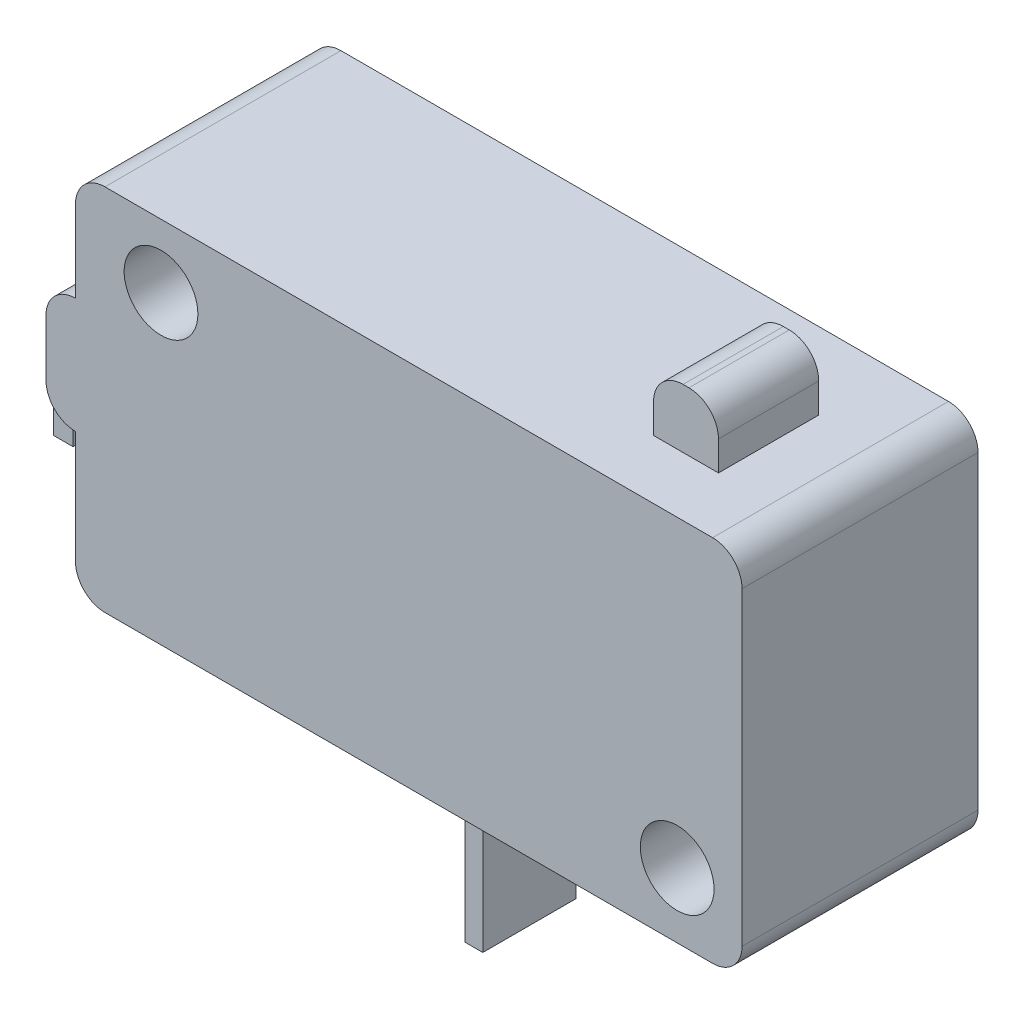
ISO-10303-21;
HEADER;
FILE_DESCRIPTION(('STEP AP214'),'2;1');
FILE_NAME('part.step','',(''),(''),'','','');
FILE_SCHEMA(('AUTOMOTIVE_DESIGN { 1 0 10303 214 1 1 1 1 }'));
ENDSEC;
DATA;
#1=APPLICATION_CONTEXT('core data for automotive mechanical design processes');
#2=APPLICATION_PROTOCOL_DEFINITION('international standard','automotive_design',2000,#1);
#3=PRODUCT_CONTEXT('',#1,'mechanical');
#4=PRODUCT('Part','Part','',(#3));
#5=PRODUCT_RELATED_PRODUCT_CATEGORY('part','',(#4));
#6=PRODUCT_DEFINITION_FORMATION('','',#4);
#7=PRODUCT_DEFINITION_CONTEXT('part definition',#1,'design');
#8=PRODUCT_DEFINITION('design','',#6,#7);
#9=PRODUCT_DEFINITION_SHAPE('','',#8);
#10=(LENGTH_UNIT() NAMED_UNIT(*) SI_UNIT(.MILLI.,.METRE.));
#11=(NAMED_UNIT(*) PLANE_ANGLE_UNIT() SI_UNIT($,.RADIAN.));
#12=(NAMED_UNIT(*) SI_UNIT($,.STERADIAN.) SOLID_ANGLE_UNIT());
#13=UNCERTAINTY_MEASURE_WITH_UNIT(LENGTH_MEASURE(1.E-05),#10,'distance_accuracy_value','');
#14=(GEOMETRIC_REPRESENTATION_CONTEXT(3) GLOBAL_UNCERTAINTY_ASSIGNED_CONTEXT((#13)) GLOBAL_UNIT_ASSIGNED_CONTEXT((#10,
#11,#12)) REPRESENTATION_CONTEXT('',''));
#15=CARTESIAN_POINT('',(0.,0.,0.));
#16=DIRECTION('',(0.,0.,1.));
#17=DIRECTION('',(1.,0.,0.));
#18=AXIS2_PLACEMENT_3D('',#15,#16,#17);
#19=CARTESIAN_POINT('',(0.,15.875,10.16));
#20=DIRECTION('',(0.,-1.,0.));
#21=DIRECTION('',(0.,0.,-1.));
#22=AXIS2_PLACEMENT_3D('',#19,#20,#21);
#23=PLANE('',#22);
#24=DIRECTION('',(-1.,0.,0.));
#25=VECTOR('',#24,1.);
#26=CARTESIAN_POINT('',(0.,15.875,10.16));
#27=LINE('',#26,#25);
#28=CARTESIAN_POINT('',(27.432,15.875,10.16));
#29=VERTEX_POINT('',#28);
#30=CARTESIAN_POINT('',(1.27,15.875,10.16));
#31=VERTEX_POINT('',#30);
#32=EDGE_CURVE('E317',#29,#31,#27,.T.);
#33=ORIENTED_EDGE('',*,*,#32,.F.);
#34=DIRECTION('',(0.,0.,-1.));
#35=VECTOR('',#34,1.);
#36=CARTESIAN_POINT('',(27.432,15.875,10.16));
#37=LINE('',#36,#35);
#38=CARTESIAN_POINT('',(27.432,15.875,0.));
#39=VERTEX_POINT('',#38);
#40=EDGE_CURVE('E191',#29,#39,#37,.T.);
#41=ORIENTED_EDGE('',*,*,#40,.T.);
#42=DIRECTION('',(-1.,0.,0.));
#43=VECTOR('',#42,1.);
#44=CARTESIAN_POINT('',(0.,15.875,0.));
#45=LINE('',#44,#43);
#46=CARTESIAN_POINT('',(1.27,15.875,0.));
#47=VERTEX_POINT('',#46);
#48=EDGE_CURVE('E326',#39,#47,#45,.T.);
#49=ORIENTED_EDGE('',*,*,#48,.T.);
#50=DIRECTION('',(0.,0.,-1.));
#51=VECTOR('',#50,1.);
#52=CARTESIAN_POINT('',(1.27,15.875,10.16));
#53=LINE('',#52,#51);
#54=EDGE_CURVE('E188',#47,#31,#53,.F.);
#55=ORIENTED_EDGE('',*,*,#54,.T.);
#56=EDGE_LOOP('',(#33,#41,#49,#55));
#57=FACE_BOUND('',#56,.T.);
#58=DIRECTION('',(0.,0.,1.));
#59=VECTOR('',#58,1.);
#60=CARTESIAN_POINT('',(22.352,15.875,3.302));
#61=LINE('',#60,#59);
#62=CARTESIAN_POINT('',(22.352,15.875,3.302));
#63=VERTEX_POINT('',#62);
#64=CARTESIAN_POINT('',(22.352,15.875,7.62));
#65=VERTEX_POINT('',#64);
#66=EDGE_CURVE('E897',#63,#65,#61,.T.);
#67=ORIENTED_EDGE('',*,*,#66,.F.);
#68=DIRECTION('',(-1.,0.,0.));
#69=VECTOR('',#68,1.);
#70=CARTESIAN_POINT('',(22.352,15.875,3.302));
#71=LINE('',#70,#69);
#72=CARTESIAN_POINT('',(25.146,15.875,3.302));
#73=VERTEX_POINT('',#72);
#74=EDGE_CURVE('E907',#73,#63,#71,.T.);
#75=ORIENTED_EDGE('',*,*,#74,.F.);
#76=DIRECTION('',(0.,0.,-1.));
#77=VECTOR('',#76,1.);
#78=CARTESIAN_POINT('',(25.146,15.875,3.302));
#79=LINE('',#78,#77);
#80=CARTESIAN_POINT('',(25.146,15.875,7.62));
#81=VERTEX_POINT('',#80);
#82=EDGE_CURVE('E915',#81,#73,#79,.T.);
#83=ORIENTED_EDGE('',*,*,#82,.F.);
#84=DIRECTION('',(1.,0.,0.));
#85=VECTOR('',#84,1.);
#86=CARTESIAN_POINT('',(22.352,15.875,7.62));
#87=LINE('',#86,#85);
#88=EDGE_CURVE('E910',#65,#81,#87,.T.);
#89=ORIENTED_EDGE('',*,*,#88,.F.);
#90=EDGE_LOOP('',(#67,#75,#83,#89));
#91=FACE_BOUND('',#90,.T.);
#92=ADVANCED_FACE('F34',(#57,#91),#23,.F.);
#93=CARTESIAN_POINT('',(0.,0.,10.16));
#94=DIRECTION('',(1.,0.,0.));
#95=DIRECTION('',(0.,0.,-1.));
#96=AXIS2_PLACEMENT_3D('',#93,#94,#95);
#97=PLANE('',#96);
#98=DIRECTION('',(0.,-1.,0.));
#99=VECTOR('',#98,1.);
#100=CARTESIAN_POINT('',(0.,0.,0.));
#101=LINE('',#100,#99);
#102=CARTESIAN_POINT('',(0.,6.12033233552722,0.));
#103=VERTEX_POINT('',#102);
#104=CARTESIAN_POINT('',(0.,1.27,0.));
#105=VERTEX_POINT('',#104);
#106=EDGE_CURVE('E227',#103,#105,#101,.T.);
#107=ORIENTED_EDGE('',*,*,#106,.T.);
#108=DIRECTION('',(0.,0.,-1.));
#109=VECTOR('',#108,1.);
#110=CARTESIAN_POINT('',(0.,1.27,10.16));
#111=LINE('',#110,#109);
#112=CARTESIAN_POINT('',(0.,1.27,10.16));
#113=VERTEX_POINT('',#112);
#114=EDGE_CURVE('E185',#105,#113,#111,.F.);
#115=ORIENTED_EDGE('',*,*,#114,.T.);
#116=DIRECTION('',(0.,-1.,0.));
#117=VECTOR('',#116,1.);
#118=CARTESIAN_POINT('',(0.,0.,10.16));
#119=LINE('',#118,#117);
#120=CARTESIAN_POINT('',(0.,6.12033233552722,10.16));
#121=VERTEX_POINT('',#120);
#122=EDGE_CURVE('E311',#121,#113,#119,.T.);
#123=ORIENTED_EDGE('',*,*,#122,.F.);
#124=DIRECTION('',(0.,0.,1.));
#125=VECTOR('',#124,1.);
#126=CARTESIAN_POINT('',(0.,6.12033233552722,0.));
#127=LINE('',#126,#125);
#128=EDGE_CURVE('E230',#103,#121,#127,.T.);
#129=ORIENTED_EDGE('',*,*,#128,.F.);
#130=EDGE_LOOP('',(#107,#115,#123,#129));
#131=FACE_BOUND('',#130,.T.);
#132=ADVANCED_FACE('F429',(#131),#97,.F.);
#133=CARTESIAN_POINT('',(0.,14.605,10.16));
#134=VERTEX_POINT('',#133);
#135=CARTESIAN_POINT('',(0.,11.0867035321363,10.16));
#136=VERTEX_POINT('',#135);
#137=EDGE_CURVE('E308',#134,#136,#119,.T.);
#138=ORIENTED_EDGE('',*,*,#137,.F.);
#139=DIRECTION('',(0.,0.,-1.));
#140=VECTOR('',#139,1.);
#141=CARTESIAN_POINT('',(0.,14.605,10.16));
#142=LINE('',#141,#140);
#143=CARTESIAN_POINT('',(0.,14.605,0.));
#144=VERTEX_POINT('',#143);
#145=EDGE_CURVE('E194',#134,#144,#142,.T.);
#146=ORIENTED_EDGE('',*,*,#145,.T.);
#147=CARTESIAN_POINT('',(0.,11.0867035321363,0.));
#148=VERTEX_POINT('',#147);
#149=EDGE_CURVE('E214',#144,#148,#101,.T.);
#150=ORIENTED_EDGE('',*,*,#149,.T.);
#151=DIRECTION('',(0.,0.,-1.));
#152=VECTOR('',#151,1.);
#153=CARTESIAN_POINT('',(0.,11.0867035321363,0.));
#154=LINE('',#153,#152);
#155=EDGE_CURVE('E224',#136,#148,#154,.T.);
#156=ORIENTED_EDGE('',*,*,#155,.F.);
#157=EDGE_LOOP('',(#138,#146,#150,#156));
#158=FACE_BOUND('',#157,.T.);
#159=ADVANCED_FACE('F223',(#158),#97,.F.);
#160=CARTESIAN_POINT('',(0.,0.,10.16));
#161=DIRECTION('',(0.,1.,0.));
#162=DIRECTION('',(0.,0.,1.));
#163=AXIS2_PLACEMENT_3D('',#160,#161,#162);
#164=PLANE('',#163);
#165=DIRECTION('',(1.,0.,0.));
#166=VECTOR('',#165,1.);
#167=CARTESIAN_POINT('',(0.,0.,0.));
#168=LINE('',#167,#166);
#169=CARTESIAN_POINT('',(1.27,0.,0.));
#170=VERTEX_POINT('',#169);
#171=CARTESIAN_POINT('',(27.432,0.,0.));
#172=VERTEX_POINT('',#171);
#173=EDGE_CURVE('E226',#170,#172,#168,.T.);
#174=ORIENTED_EDGE('',*,*,#173,.T.);
#175=DIRECTION('',(0.,0.,-1.));
#176=VECTOR('',#175,1.);
#177=CARTESIAN_POINT('',(27.432,0.,10.16));
#178=LINE('',#177,#176);
#179=CARTESIAN_POINT('',(27.432,0.,10.16));
#180=VERTEX_POINT('',#179);
#181=EDGE_CURVE('E170',#172,#180,#178,.F.);
#182=ORIENTED_EDGE('',*,*,#181,.T.);
#183=DIRECTION('',(1.,0.,0.));
#184=VECTOR('',#183,1.);
#185=CARTESIAN_POINT('',(0.,0.,10.16));
#186=LINE('',#185,#184);
#187=CARTESIAN_POINT('',(1.27,0.,10.16));
#188=VERTEX_POINT('',#187);
#189=EDGE_CURVE('E310',#188,#180,#186,.T.);
#190=ORIENTED_EDGE('',*,*,#189,.F.);
#191=DIRECTION('',(0.,0.,-1.));
#192=VECTOR('',#191,1.);
#193=CARTESIAN_POINT('',(1.27,0.,10.16));
#194=LINE('',#193,#192);
#195=EDGE_CURVE('E167',#188,#170,#194,.T.);
#196=ORIENTED_EDGE('',*,*,#195,.T.);
#197=EDGE_LOOP('',(#174,#182,#190,#196));
#198=FACE_BOUND('',#197,.T.);
#199=DIRECTION('',(0.,0.,-1.));
#200=VECTOR('',#199,1.);
#201=CARTESIAN_POINT('',(14.9668113061045,0.,4.32932291865937));
#202=LINE('',#201,#200);
#203=CARTESIAN_POINT('',(14.9668113061045,0.,8.35123363118148));
#204=VERTEX_POINT('',#203);
#205=CARTESIAN_POINT('',(14.9668113061045,0.,4.32932291865937));
#206=VERTEX_POINT('',#205);
#207=EDGE_CURVE('E264',#204,#206,#202,.T.);
#208=ORIENTED_EDGE('',*,*,#207,.F.);
#209=DIRECTION('',(-1.,0.,0.));
#210=VECTOR('',#209,1.);
#211=CARTESIAN_POINT('',(14.9668113061045,0.,8.35123363118148));
#212=LINE('',#211,#210);
#213=CARTESIAN_POINT('',(15.7304652388619,0.,8.35123363118148));
#214=VERTEX_POINT('',#213);
#215=EDGE_CURVE('E269',#214,#204,#212,.T.);
#216=ORIENTED_EDGE('',*,*,#215,.F.);
#217=DIRECTION('',(0.,0.,1.));
#218=VECTOR('',#217,1.);
#219=CARTESIAN_POINT('',(15.7304652388619,0.,4.32932291865937));
#220=LINE('',#219,#218);
#221=CARTESIAN_POINT('',(15.7304652388619,0.,4.32932291865937));
#222=VERTEX_POINT('',#221);
#223=EDGE_CURVE('E284',#222,#214,#220,.T.);
#224=ORIENTED_EDGE('',*,*,#223,.F.);
#225=DIRECTION('',(1.,0.,0.));
#226=VECTOR('',#225,1.);
#227=CARTESIAN_POINT('',(14.9668113061045,0.,4.32932291865937));
#228=LINE('',#227,#226);
#229=EDGE_CURVE('E281',#206,#222,#228,.T.);
#230=ORIENTED_EDGE('',*,*,#229,.F.);
#231=EDGE_LOOP('',(#208,#216,#224,#230));
#232=FACE_BOUND('',#231,.T.);
#233=ADVANCED_FACE('F437',(#198,#232),#164,.F.);
#234=CARTESIAN_POINT('',(28.702,0.,10.16));
#235=DIRECTION('',(-1.,0.,0.));
#236=DIRECTION('',(0.,0.,1.));
#237=AXIS2_PLACEMENT_3D('',#234,#235,#236);
#238=PLANE('',#237);
#239=DIRECTION('',(0.,1.,0.));
#240=VECTOR('',#239,1.);
#241=CARTESIAN_POINT('',(28.702,0.,10.16));
#242=LINE('',#241,#240);
#243=CARTESIAN_POINT('',(28.702,1.27,10.16));
#244=VERTEX_POINT('',#243);
#245=CARTESIAN_POINT('',(28.702,14.605,10.16));
#246=VERTEX_POINT('',#245);
#247=EDGE_CURVE('E314',#244,#246,#242,.T.);
#248=ORIENTED_EDGE('',*,*,#247,.F.);
#249=DIRECTION('',(0.,0.,-1.));
#250=VECTOR('',#249,1.);
#251=CARTESIAN_POINT('',(28.702,1.27,10.16));
#252=LINE('',#251,#250);
#253=CARTESIAN_POINT('',(28.702,1.27,0.));
#254=VERTEX_POINT('',#253);
#255=EDGE_CURVE('E152',#244,#254,#252,.T.);
#256=ORIENTED_EDGE('',*,*,#255,.T.);
#257=DIRECTION('',(0.,1.,0.));
#258=VECTOR('',#257,1.);
#259=CARTESIAN_POINT('',(28.702,0.,0.));
#260=LINE('',#259,#258);
#261=CARTESIAN_POINT('',(28.702,14.605,0.));
#262=VERTEX_POINT('',#261);
#263=EDGE_CURVE('E323',#254,#262,#260,.T.);
#264=ORIENTED_EDGE('',*,*,#263,.T.);
#265=DIRECTION('',(0.,0.,-1.));
#266=VECTOR('',#265,1.);
#267=CARTESIAN_POINT('',(28.702,14.605,10.16));
#268=LINE('',#267,#266);
#269=EDGE_CURVE('E149',#262,#246,#268,.F.);
#270=ORIENTED_EDGE('',*,*,#269,.T.);
#271=EDGE_LOOP('',(#248,#256,#264,#270));
#272=FACE_BOUND('',#271,.T.);
#273=ADVANCED_FACE('F447',(#272),#238,.F.);
#274=CARTESIAN_POINT('',(0.,0.,10.16));
#275=DIRECTION('',(0.,0.,-1.));
#276=DIRECTION('',(-1.,0.,0.));
#277=AXIS2_PLACEMENT_3D('',#274,#275,#276);
#278=PLANE('',#277);
#279=CARTESIAN_POINT('',(25.908,2.794,10.16));
#280=DIRECTION('',(0.,0.,1.));
#281=DIRECTION('',(1.,0.,0.));
#282=AXIS2_PLACEMENT_3D('',#279,#280,#281);
#283=CIRCLE('',#282,1.5875);
#284=CARTESIAN_POINT('',(27.4955,2.794,10.16));
#285=VERTEX_POINT('',#284);
#286=EDGE_CURVE('E300',#285,#285,#283,.T.);
#287=ORIENTED_EDGE('',*,*,#286,.F.);
#288=EDGE_LOOP('',(#287));
#289=FACE_BOUND('',#288,.T.);
#290=CARTESIAN_POINT('',(3.68299999999999,13.1318,10.16));
#291=DIRECTION('',(0.,0.,1.));
#292=DIRECTION('',(1.,0.,0.));
#293=AXIS2_PLACEMENT_3D('',#290,#291,#292);
#294=CIRCLE('',#293,1.5875);
#295=CARTESIAN_POINT('',(5.27049999999999,13.1318,10.16));
#296=VERTEX_POINT('',#295);
#297=EDGE_CURVE('E304',#296,#296,#294,.T.);
#298=ORIENTED_EDGE('',*,*,#297,.F.);
#299=EDGE_LOOP('',(#298));
#300=FACE_BOUND('',#299,.T.);
#301=DIRECTION('',(0.,1.,0.));
#302=VECTOR('',#301,1.);
#303=CARTESIAN_POINT('',(-1.27,6.12033233552722,10.16));
#304=LINE('',#303,#302);
#305=CARTESIAN_POINT('',(-1.27,7.39033233552722,10.16));
#306=VERTEX_POINT('',#305);
#307=CARTESIAN_POINT('',(-1.27,9.81670353213626,10.16));
#308=VERTEX_POINT('',#307);
#309=EDGE_CURVE('E106',#306,#308,#304,.T.);
#310=ORIENTED_EDGE('',*,*,#309,.F.);
#311=CARTESIAN_POINT('',(0.,7.39033233552722,10.16));
#312=DIRECTION('',(0.,0.,-1.));
#313=DIRECTION('',(-1.,0.,0.));
#314=AXIS2_PLACEMENT_3D('',#311,#312,#313);
#315=CIRCLE('',#314,1.27);
#316=EDGE_CURVE('E204',#306,#121,#315,.F.);
#317=ORIENTED_EDGE('',*,*,#316,.T.);
#318=ORIENTED_EDGE('',*,*,#122,.T.);
#319=CARTESIAN_POINT('',(1.27,1.27,10.16));
#320=DIRECTION('',(0.,0.,-1.));
#321=DIRECTION('',(-1.,0.,0.));
#322=AXIS2_PLACEMENT_3D('',#319,#320,#321);
#323=CIRCLE('',#322,1.27);
#324=EDGE_CURVE('E179',#113,#188,#323,.F.);
#325=ORIENTED_EDGE('',*,*,#324,.T.);
#326=ORIENTED_EDGE('',*,*,#189,.T.);
#327=CARTESIAN_POINT('',(27.432,1.27,10.16));
#328=DIRECTION('',(0.,0.,-1.));
#329=DIRECTION('',(-1.,0.,0.));
#330=AXIS2_PLACEMENT_3D('',#327,#328,#329);
#331=CIRCLE('',#330,1.27);
#332=EDGE_CURVE('E182',#180,#244,#331,.F.);
#333=ORIENTED_EDGE('',*,*,#332,.T.);
#334=ORIENTED_EDGE('',*,*,#247,.T.);
#335=CARTESIAN_POINT('',(27.432,14.605,10.16));
#336=DIRECTION('',(0.,0.,-1.));
#337=DIRECTION('',(-1.,0.,0.));
#338=AXIS2_PLACEMENT_3D('',#335,#336,#337);
#339=CIRCLE('',#338,1.27);
#340=EDGE_CURVE('E176',#246,#29,#339,.F.);
#341=ORIENTED_EDGE('',*,*,#340,.T.);
#342=ORIENTED_EDGE('',*,*,#32,.T.);
#343=CARTESIAN_POINT('',(1.27,14.605,10.16));
#344=DIRECTION('',(0.,0.,-1.));
#345=DIRECTION('',(-1.,0.,0.));
#346=AXIS2_PLACEMENT_3D('',#343,#344,#345);
#347=CIRCLE('',#346,1.27);
#348=EDGE_CURVE('E173',#31,#134,#347,.F.);
#349=ORIENTED_EDGE('',*,*,#348,.T.);
#350=ORIENTED_EDGE('',*,*,#137,.T.);
#351=CARTESIAN_POINT('',(0.,9.81670353213626,10.16));
#352=DIRECTION('',(0.,0.,-1.));
#353=DIRECTION('',(-1.,0.,0.));
#354=AXIS2_PLACEMENT_3D('',#351,#352,#353);
#355=CIRCLE('',#354,1.27);
#356=EDGE_CURVE('E53',#136,#308,#355,.F.);
#357=ORIENTED_EDGE('',*,*,#356,.T.);
#358=EDGE_LOOP('',(#310,#317,#318,#325,#326,#333,#334,#341,#342,#349,#350,#357));
#359=FACE_BOUND('',#358,.T.);
#360=ADVANCED_FACE('F426',(#289,#300,#359),#278,.F.);
#361=CARTESIAN_POINT('',(0.,0.,0.));
#362=DIRECTION('',(0.,0.,-1.));
#363=DIRECTION('',(-1.,0.,0.));
#364=AXIS2_PLACEMENT_3D('',#361,#362,#363);
#365=PLANE('',#364);
#366=CARTESIAN_POINT('',(25.908,2.794,0.));
#367=DIRECTION('',(0.,0.,-1.));
#368=DIRECTION('',(-1.,0.,0.));
#369=AXIS2_PLACEMENT_3D('',#366,#367,#368);
#370=CIRCLE('',#369,1.5875);
#371=CARTESIAN_POINT('',(24.3205,2.794,0.));
#372=VERTEX_POINT('',#371);
#373=EDGE_CURVE('E303',#372,#372,#370,.T.);
#374=ORIENTED_EDGE('',*,*,#373,.F.);
#375=EDGE_LOOP('',(#374));
#376=FACE_BOUND('',#375,.T.);
#377=CARTESIAN_POINT('',(3.68299999999999,13.1318,0.));
#378=DIRECTION('',(0.,0.,-1.));
#379=DIRECTION('',(-1.,0.,0.));
#380=AXIS2_PLACEMENT_3D('',#377,#378,#379);
#381=CIRCLE('',#380,1.5875);
#382=CARTESIAN_POINT('',(2.09549999999999,13.1318,0.));
#383=VERTEX_POINT('',#382);
#384=EDGE_CURVE('E307',#383,#383,#381,.T.);
#385=ORIENTED_EDGE('',*,*,#384,.F.);
#386=EDGE_LOOP('',(#385));
#387=FACE_BOUND('',#386,.T.);
#388=ORIENTED_EDGE('',*,*,#106,.F.);
#389=CARTESIAN_POINT('',(0.,7.39033233552722,0.));
#390=DIRECTION('',(0.,0.,-1.));
#391=DIRECTION('',(-1.,0.,0.));
#392=AXIS2_PLACEMENT_3D('',#389,#390,#391);
#393=CIRCLE('',#392,1.27);
#394=CARTESIAN_POINT('',(-1.27,7.39033233552722,0.));
#395=VERTEX_POINT('',#394);
#396=EDGE_CURVE('E11',#103,#395,#393,.T.);
#397=ORIENTED_EDGE('',*,*,#396,.T.);
#398=DIRECTION('',(0.,-1.,0.));
#399=VECTOR('',#398,1.);
#400=CARTESIAN_POINT('',(-1.27,6.12033233552722,0.));
#401=LINE('',#400,#399);
#402=CARTESIAN_POINT('',(-1.27,9.81670353213626,0.));
#403=VERTEX_POINT('',#402);
#404=EDGE_CURVE('E108',#403,#395,#401,.T.);
#405=ORIENTED_EDGE('',*,*,#404,.F.);
#406=CARTESIAN_POINT('',(0.,9.81670353213626,0.));
#407=DIRECTION('',(0.,0.,-1.));
#408=DIRECTION('',(-1.,0.,0.));
#409=AXIS2_PLACEMENT_3D('',#406,#407,#408);
#410=CIRCLE('',#409,1.27);
#411=EDGE_CURVE('E44',#403,#148,#410,.T.);
#412=ORIENTED_EDGE('',*,*,#411,.T.);
#413=ORIENTED_EDGE('',*,*,#149,.F.);
#414=CARTESIAN_POINT('',(1.27,14.605,0.));
#415=DIRECTION('',(0.,0.,-1.));
#416=DIRECTION('',(-1.,0.,0.));
#417=AXIS2_PLACEMENT_3D('',#414,#415,#416);
#418=CIRCLE('',#417,1.27);
#419=EDGE_CURVE('E155',#144,#47,#418,.T.);
#420=ORIENTED_EDGE('',*,*,#419,.T.);
#421=ORIENTED_EDGE('',*,*,#48,.F.);
#422=CARTESIAN_POINT('',(27.432,14.605,0.));
#423=DIRECTION('',(0.,0.,-1.));
#424=DIRECTION('',(-1.,0.,0.));
#425=AXIS2_PLACEMENT_3D('',#422,#423,#424);
#426=CIRCLE('',#425,1.27);
#427=EDGE_CURVE('E158',#39,#262,#426,.T.);
#428=ORIENTED_EDGE('',*,*,#427,.T.);
#429=ORIENTED_EDGE('',*,*,#263,.F.);
#430=CARTESIAN_POINT('',(27.432,1.27,0.));
#431=DIRECTION('',(0.,0.,-1.));
#432=DIRECTION('',(-1.,0.,0.));
#433=AXIS2_PLACEMENT_3D('',#430,#431,#432);
#434=CIRCLE('',#433,1.27);
#435=EDGE_CURVE('E164',#254,#172,#434,.T.);
#436=ORIENTED_EDGE('',*,*,#435,.T.);
#437=ORIENTED_EDGE('',*,*,#173,.F.);
#438=CARTESIAN_POINT('',(1.27,1.27,0.));
#439=DIRECTION('',(0.,0.,-1.));
#440=DIRECTION('',(-1.,0.,0.));
#441=AXIS2_PLACEMENT_3D('',#438,#439,#440);
#442=CIRCLE('',#441,1.27);
#443=EDGE_CURVE('E161',#170,#105,#442,.T.);
#444=ORIENTED_EDGE('',*,*,#443,.T.);
#445=EDGE_LOOP('',(#388,#397,#405,#412,#413,#420,#421,#428,#429,#436,#437,#444));
#446=FACE_BOUND('',#445,.T.);
#447=ADVANCED_FACE('F212',(#376,#387,#446),#365,.T.);
#448=CARTESIAN_POINT('',(3.68299999999999,13.1318,-2.2606));
#449=DIRECTION('',(0.,0.,1.));
#450=DIRECTION('',(1.,0.,0.));
#451=AXIS2_PLACEMENT_3D('',#448,#449,#450);
#452=CYLINDRICAL_SURFACE('',#451,1.5875);
#453=ORIENTED_EDGE('',*,*,#384,.T.);
#454=EDGE_LOOP('',(#453));
#455=FACE_BOUND('',#454,.T.);
#456=ORIENTED_EDGE('',*,*,#297,.T.);
#457=EDGE_LOOP('',(#456));
#458=FACE_BOUND('',#457,.T.);
#459=ADVANCED_FACE('F558',(#455,#458),#452,.F.);
#460=CARTESIAN_POINT('',(25.908,2.794,-2.2606));
#461=DIRECTION('',(0.,0.,1.));
#462=DIRECTION('',(1.,0.,0.));
#463=AXIS2_PLACEMENT_3D('',#460,#461,#462);
#464=CYLINDRICAL_SURFACE('',#463,1.5875);
#465=ORIENTED_EDGE('',*,*,#373,.T.);
#466=EDGE_LOOP('',(#465));
#467=FACE_BOUND('',#466,.T.);
#468=ORIENTED_EDGE('',*,*,#286,.T.);
#469=EDGE_LOOP('',(#468));
#470=FACE_BOUND('',#469,.T.);
#471=ADVANCED_FACE('F805',(#467,#470),#464,.F.);
#472=CARTESIAN_POINT('',(14.9668113061045,-6.35,4.32932291865937));
#473=DIRECTION('',(1.,0.,0.));
#474=DIRECTION('',(0.,0.,-1.));
#475=AXIS2_PLACEMENT_3D('',#472,#473,#474);
#476=PLANE('',#475);
#477=ORIENTED_EDGE('',*,*,#207,.T.);
#478=DIRECTION('',(0.,1.,0.));
#479=VECTOR('',#478,1.);
#480=CARTESIAN_POINT('',(14.9668113061045,-6.35,4.32932291865937));
#481=LINE('',#480,#479);
#482=CARTESIAN_POINT('',(14.9668113061045,-6.35,4.32932291865937));
#483=VERTEX_POINT('',#482);
#484=EDGE_CURVE('E297',#483,#206,#481,.T.);
#485=ORIENTED_EDGE('',*,*,#484,.F.);
#486=DIRECTION('',(0.,0.,-1.));
#487=VECTOR('',#486,1.);
#488=CARTESIAN_POINT('',(14.9668113061045,-6.35,4.32932291865937));
#489=LINE('',#488,#487);
#490=CARTESIAN_POINT('',(14.9668113061045,-6.35,8.35123363118148));
#491=VERTEX_POINT('',#490);
#492=EDGE_CURVE('E265',#491,#483,#489,.T.);
#493=ORIENTED_EDGE('',*,*,#492,.F.);
#494=DIRECTION('',(0.,1.,0.));
#495=VECTOR('',#494,1.);
#496=CARTESIAN_POINT('',(14.9668113061045,-6.35,8.35123363118148));
#497=LINE('',#496,#495);
#498=EDGE_CURVE('E278',#491,#204,#497,.T.);
#499=ORIENTED_EDGE('',*,*,#498,.T.);
#500=EDGE_LOOP('',(#477,#485,#493,#499));
#501=FACE_BOUND('',#500,.T.);
#502=ADVANCED_FACE('F796',(#501),#476,.F.);
#503=CARTESIAN_POINT('',(14.9668113061045,-6.35,4.32932291865937));
#504=DIRECTION('',(0.,0.,1.));
#505=DIRECTION('',(1.,0.,0.));
#506=AXIS2_PLACEMENT_3D('',#503,#504,#505);
#507=PLANE('',#506);
#508=ORIENTED_EDGE('',*,*,#229,.T.);
#509=DIRECTION('',(0.,1.,0.));
#510=VECTOR('',#509,1.);
#511=CARTESIAN_POINT('',(15.7304652388619,-6.35,4.32932291865937));
#512=LINE('',#511,#510);
#513=CARTESIAN_POINT('',(15.7304652388619,-6.35,4.32932291865937));
#514=VERTEX_POINT('',#513);
#515=EDGE_CURVE('E294',#514,#222,#512,.T.);
#516=ORIENTED_EDGE('',*,*,#515,.F.);
#517=DIRECTION('',(1.,0.,0.));
#518=VECTOR('',#517,1.);
#519=CARTESIAN_POINT('',(14.9668113061045,-6.35,4.32932291865937));
#520=LINE('',#519,#518);
#521=EDGE_CURVE('E268',#483,#514,#520,.T.);
#522=ORIENTED_EDGE('',*,*,#521,.F.);
#523=ORIENTED_EDGE('',*,*,#484,.T.);
#524=EDGE_LOOP('',(#508,#516,#522,#523));
#525=FACE_BOUND('',#524,.T.);
#526=ADVANCED_FACE('F787',(#525),#507,.F.);
#527=CARTESIAN_POINT('',(15.7304652388619,-6.35,4.32932291865937));
#528=DIRECTION('',(-1.,0.,0.));
#529=DIRECTION('',(0.,0.,1.));
#530=AXIS2_PLACEMENT_3D('',#527,#528,#529);
#531=PLANE('',#530);
#532=ORIENTED_EDGE('',*,*,#223,.T.);
#533=DIRECTION('',(0.,1.,0.));
#534=VECTOR('',#533,1.);
#535=CARTESIAN_POINT('',(15.7304652388619,-6.35,8.35123363118148));
#536=LINE('',#535,#534);
#537=CARTESIAN_POINT('',(15.7304652388619,-6.35,8.35123363118148));
#538=VERTEX_POINT('',#537);
#539=EDGE_CURVE('E291',#538,#214,#536,.T.);
#540=ORIENTED_EDGE('',*,*,#539,.F.);
#541=DIRECTION('',(0.,0.,1.));
#542=VECTOR('',#541,1.);
#543=CARTESIAN_POINT('',(15.7304652388619,-6.35,4.32932291865937));
#544=LINE('',#543,#542);
#545=EDGE_CURVE('E272',#514,#538,#544,.T.);
#546=ORIENTED_EDGE('',*,*,#545,.F.);
#547=ORIENTED_EDGE('',*,*,#515,.T.);
#548=EDGE_LOOP('',(#532,#540,#546,#547));
#549=FACE_BOUND('',#548,.T.);
#550=ADVANCED_FACE('F777',(#549),#531,.F.);
#551=CARTESIAN_POINT('',(14.9668113061045,-6.35,8.35123363118148));
#552=DIRECTION('',(0.,0.,-1.));
#553=DIRECTION('',(-1.,0.,0.));
#554=AXIS2_PLACEMENT_3D('',#551,#552,#553);
#555=PLANE('',#554);
#556=ORIENTED_EDGE('',*,*,#215,.T.);
#557=ORIENTED_EDGE('',*,*,#498,.F.);
#558=DIRECTION('',(-1.,0.,0.));
#559=VECTOR('',#558,1.);
#560=CARTESIAN_POINT('',(14.9668113061045,-6.35,8.35123363118148));
#561=LINE('',#560,#559);
#562=EDGE_CURVE('E275',#538,#491,#561,.T.);
#563=ORIENTED_EDGE('',*,*,#562,.F.);
#564=ORIENTED_EDGE('',*,*,#539,.T.);
#565=EDGE_LOOP('',(#556,#557,#563,#564));
#566=FACE_BOUND('',#565,.T.);
#567=ADVANCED_FACE('F769',(#566),#555,.F.);
#568=CARTESIAN_POINT('',(0.,-6.35,0.));
#569=DIRECTION('',(0.,1.,0.));
#570=DIRECTION('',(0.,0.,1.));
#571=AXIS2_PLACEMENT_3D('',#568,#569,#570);
#572=PLANE('',#571);
#573=ORIENTED_EDGE('',*,*,#492,.T.);
#574=ORIENTED_EDGE('',*,*,#521,.T.);
#575=ORIENTED_EDGE('',*,*,#545,.T.);
#576=ORIENTED_EDGE('',*,*,#562,.T.);
#577=EDGE_LOOP('',(#573,#574,#575,#576));
#578=FACE_BOUND('',#577,.T.);
#579=ADVANCED_FACE('F568',(#578),#572,.F.);
#580=CARTESIAN_POINT('',(-1.27,0.,0.));
#581=DIRECTION('',(1.,0.,0.));
#582=DIRECTION('',(0.,0.,-1.));
#583=AXIS2_PLACEMENT_3D('',#580,#581,#582);
#584=PLANE('',#583);
#585=ORIENTED_EDGE('',*,*,#404,.T.);
#586=DIRECTION('',(0.,0.,1.));
#587=VECTOR('',#586,1.);
#588=CARTESIAN_POINT('',(-1.27,7.39033233552722,0.));
#589=LINE('',#588,#587);
#590=EDGE_CURVE('E200',#395,#306,#589,.T.);
#591=ORIENTED_EDGE('',*,*,#590,.T.);
#592=ORIENTED_EDGE('',*,*,#309,.T.);
#593=DIRECTION('',(0.,0.,-1.));
#594=VECTOR('',#593,1.);
#595=CARTESIAN_POINT('',(-1.27,9.81670353213626,0.));
#596=LINE('',#595,#594);
#597=EDGE_CURVE('E197',#308,#403,#596,.T.);
#598=ORIENTED_EDGE('',*,*,#597,.T.);
#599=EDGE_LOOP('',(#585,#591,#592,#598));
#600=FACE_BOUND('',#599,.T.);
#601=ADVANCED_FACE('F423',(#600),#584,.F.);
#602=CARTESIAN_POINT('',(-2.21466966969786,3.38814745974652,3.93355438743015));
#603=DIRECTION('',(-1.,0.,0.));
#604=DIRECTION('',(0.,0.,1.));
#605=AXIS2_PLACEMENT_3D('',#602,#603,#604);
#606=PLANE('',#605);
#607=DIRECTION('',(0.,0.,1.));
#608=VECTOR('',#607,1.);
#609=CARTESIAN_POINT('',(-2.21466966969786,6.43614745974652,3.93355438743015));
#610=LINE('',#609,#608);
#611=CARTESIAN_POINT('',(-2.21466966969786,6.43614745974652,3.93355438743015));
#612=VERTEX_POINT('',#611);
#613=CARTESIAN_POINT('',(-2.21466966969786,6.43614745974652,8.05134539743335));
#614=VERTEX_POINT('',#613);
#615=EDGE_CURVE('E92',#612,#614,#610,.T.);
#616=ORIENTED_EDGE('',*,*,#615,.T.);
#617=DIRECTION('',(0.,1.,0.));
#618=VECTOR('',#617,1.);
#619=CARTESIAN_POINT('',(-2.21466966969786,3.38814745974652,8.05134539743335));
#620=LINE('',#619,#618);
#621=CARTESIAN_POINT('',(-2.21466966969786,3.38814745974652,8.05134539743335));
#622=VERTEX_POINT('',#621);
#623=EDGE_CURVE('E102',#622,#614,#620,.T.);
#624=ORIENTED_EDGE('',*,*,#623,.F.);
#625=DIRECTION('',(0.,0.,1.));
#626=VECTOR('',#625,1.);
#627=CARTESIAN_POINT('',(-2.21466966969786,3.38814745974652,3.93355438743015));
#628=LINE('',#627,#626);
#629=CARTESIAN_POINT('',(-2.21466966969786,3.38814745974652,3.93355438743015));
#630=VERTEX_POINT('',#629);
#631=EDGE_CURVE('E243',#630,#622,#628,.T.);
#632=ORIENTED_EDGE('',*,*,#631,.F.);
#633=DIRECTION('',(0.,1.,0.));
#634=VECTOR('',#633,1.);
#635=CARTESIAN_POINT('',(-2.21466966969786,3.38814745974652,3.93355438743015));
#636=LINE('',#635,#634);
#637=EDGE_CURVE('E252',#630,#612,#636,.T.);
#638=ORIENTED_EDGE('',*,*,#637,.T.);
#639=EDGE_LOOP('',(#616,#624,#632,#638));
#640=FACE_BOUND('',#639,.T.);
#641=ADVANCED_FACE('F567',(#640),#606,.F.);
#642=CARTESIAN_POINT('',(0.,3.38814745974652,0.));
#643=DIRECTION('',(0.,1.,0.));
#644=DIRECTION('',(0.,0.,1.));
#645=AXIS2_PLACEMENT_3D('',#642,#643,#644);
#646=PLANE('',#645);
#647=DIRECTION('',(0.,0.,-1.));
#648=VECTOR('',#647,1.);
#649=CARTESIAN_POINT('',(-3.048,3.38814745974652,3.93355438743015));
#650=LINE('',#649,#648);
#651=CARTESIAN_POINT('',(-3.048,3.38814745974652,8.05134539743335));
#652=VERTEX_POINT('',#651);
#653=CARTESIAN_POINT('',(-3.048,3.38814745974652,3.93355438743015));
#654=VERTEX_POINT('',#653);
#655=EDGE_CURVE('E237',#652,#654,#650,.T.);
#656=ORIENTED_EDGE('',*,*,#655,.T.);
#657=DIRECTION('',(1.,0.,0.));
#658=VECTOR('',#657,1.);
#659=CARTESIAN_POINT('',(-3.048,3.38814745974652,3.93355438743015));
#660=LINE('',#659,#658);
#661=EDGE_CURVE('E240',#654,#630,#660,.T.);
#662=ORIENTED_EDGE('',*,*,#661,.T.);
#663=ORIENTED_EDGE('',*,*,#631,.T.);
#664=DIRECTION('',(-1.,0.,0.));
#665=VECTOR('',#664,1.);
#666=CARTESIAN_POINT('',(-3.048,3.38814745974652,8.05134539743335));
#667=LINE('',#666,#665);
#668=EDGE_CURVE('E246',#622,#652,#667,.T.);
#669=ORIENTED_EDGE('',*,*,#668,.T.);
#670=EDGE_LOOP('',(#656,#662,#663,#669));
#671=FACE_BOUND('',#670,.T.);
#672=ADVANCED_FACE('F582',(#671),#646,.F.);
#673=CARTESIAN_POINT('',(-3.048,0.,0.));
#674=DIRECTION('',(-1.,0.,0.));
#675=DIRECTION('',(0.,0.,1.));
#676=AXIS2_PLACEMENT_3D('',#673,#674,#675);
#677=PLANE('',#676);
#678=DIRECTION('',(0.,1.,0.));
#679=VECTOR('',#678,1.);
#680=CARTESIAN_POINT('',(-3.048,7.3066951879337,8.05134539743335));
#681=LINE('',#680,#679);
#682=CARTESIAN_POINT('',(-3.048,6.7986951879337,8.05134539743335));
#683=VERTEX_POINT('',#682);
#684=EDGE_CURVE('E258',#652,#683,#681,.T.);
#685=ORIENTED_EDGE('',*,*,#684,.T.);
#686=DIRECTION('',(0.,0.,-1.));
#687=VECTOR('',#686,1.);
#688=CARTESIAN_POINT('',(-3.048,6.7986951879337,3.93355438743015));
#689=LINE('',#688,#687);
#690=CARTESIAN_POINT('',(-3.048,6.7986951879337,3.93355438743015));
#691=VERTEX_POINT('',#690);
#692=EDGE_CURVE('E319',#683,#691,#689,.T.);
#693=ORIENTED_EDGE('',*,*,#692,.T.);
#694=DIRECTION('',(0.,-1.,0.));
#695=VECTOR('',#694,1.);
#696=CARTESIAN_POINT('',(-3.048,7.3066951879337,3.93355438743015));
#697=LINE('',#696,#695);
#698=EDGE_CURVE('E255',#691,#654,#697,.T.);
#699=ORIENTED_EDGE('',*,*,#698,.T.);
#700=ORIENTED_EDGE('',*,*,#655,.F.);
#701=EDGE_LOOP('',(#685,#693,#699,#700));
#702=FACE_BOUND('',#701,.T.);
#703=ADVANCED_FACE('F483',(#702),#677,.T.);
#704=CARTESIAN_POINT('',(-2.54,6.7986951879337,0.));
#705=DIRECTION('',(0.,0.,1.));
#706=DIRECTION('',(1.,0.,0.));
#707=AXIS2_PLACEMENT_3D('',#704,#705,#706);
#708=CYLINDRICAL_SURFACE('',#707,0.508);
#709=CARTESIAN_POINT('',(-2.54,6.7986951879337,8.05134539743335));
#710=DIRECTION('',(0.,0.,-1.));
#711=DIRECTION('',(-1.,0.,0.));
#712=AXIS2_PLACEMENT_3D('',#709,#710,#711);
#713=CIRCLE('',#712,0.508);
#714=CARTESIAN_POINT('',(-2.54,7.3066951879337,8.05134539743335));
#715=VERTEX_POINT('',#714);
#716=EDGE_CURVE('E113',#715,#683,#713,.F.);
#717=ORIENTED_EDGE('',*,*,#716,.F.);
#718=DIRECTION('',(0.,0.,-1.));
#719=VECTOR('',#718,1.);
#720=CARTESIAN_POINT('',(-2.54,7.3066951879337,8.05134539743335));
#721=LINE('',#720,#719);
#722=CARTESIAN_POINT('',(-2.54,7.3066951879337,3.93355438743015));
#723=VERTEX_POINT('',#722);
#724=EDGE_CURVE('E118',#723,#715,#721,.F.);
#725=ORIENTED_EDGE('',*,*,#724,.F.);
#726=CARTESIAN_POINT('',(-2.54,6.7986951879337,3.93355438743015));
#727=DIRECTION('',(0.,0.,1.));
#728=DIRECTION('',(1.,0.,0.));
#729=AXIS2_PLACEMENT_3D('',#726,#727,#728);
#730=CIRCLE('',#729,0.508);
#731=EDGE_CURVE('E125',#691,#723,#730,.F.);
#732=ORIENTED_EDGE('',*,*,#731,.F.);
#733=ORIENTED_EDGE('',*,*,#692,.F.);
#734=EDGE_LOOP('',(#717,#725,#732,#733));
#735=FACE_BOUND('',#734,.T.);
#736=ADVANCED_FACE('F348',(#735),#708,.T.);
#737=CARTESIAN_POINT('',(-3.048,7.3066951879337,3.93355438743015));
#738=DIRECTION('',(0.,-1.,0.));
#739=DIRECTION('',(0.,0.,-1.));
#740=AXIS2_PLACEMENT_3D('',#737,#738,#739);
#741=PLANE('',#740);
#742=DIRECTION('',(0.,0.,1.));
#743=VECTOR('',#742,1.);
#744=CARTESIAN_POINT('',(-1.26724300256203,7.3066951879337,5.99244989243175));
#745=LINE('',#744,#743);
#746=CARTESIAN_POINT('',(-1.26724300256203,7.3066951879337,3.93355438743015));
#747=VERTEX_POINT('',#746);
#748=CARTESIAN_POINT('',(-1.26724300256203,7.3066951879337,8.05134539743335));
#749=VERTEX_POINT('',#748);
#750=EDGE_CURVE('E105',#747,#749,#745,.T.);
#751=ORIENTED_EDGE('',*,*,#750,.F.);
#752=DIRECTION('',(1.,0.,0.));
#753=VECTOR('',#752,1.);
#754=CARTESIAN_POINT('',(-3.048,7.3066951879337,3.93355438743015));
#755=LINE('',#754,#753);
#756=EDGE_CURVE('E260',#723,#747,#755,.T.);
#757=ORIENTED_EDGE('',*,*,#756,.F.);
#758=ORIENTED_EDGE('',*,*,#724,.T.);
#759=DIRECTION('',(1.,0.,0.));
#760=VECTOR('',#759,1.);
#761=CARTESIAN_POINT('',(-3.048,7.3066951879337,8.05134539743335));
#762=LINE('',#761,#760);
#763=EDGE_CURVE('E103',#715,#749,#762,.T.);
#764=ORIENTED_EDGE('',*,*,#763,.T.);
#765=EDGE_LOOP('',(#751,#757,#758,#764));
#766=FACE_BOUND('',#765,.T.);
#767=ADVANCED_FACE('F347',(#766),#741,.F.);
#768=CARTESIAN_POINT('',(-3.048,7.3066951879337,8.05134539743335));
#769=DIRECTION('',(0.,0.,-1.));
#770=DIRECTION('',(-1.,0.,0.));
#771=AXIS2_PLACEMENT_3D('',#768,#769,#770);
#772=PLANE('',#771);
#773=CARTESIAN_POINT('',(0.,7.39033233552722,8.05134539743335));
#774=DIRECTION('',(0.,0.,-1.));
#775=DIRECTION('',(-1.,0.,0.));
#776=AXIS2_PLACEMENT_3D('',#773,#774,#775);
#777=CIRCLE('',#776,1.27);
#778=CARTESIAN_POINT('',(-0.838111700688737,6.43614745974652,8.05134539743335));
#779=VERTEX_POINT('',#778);
#780=EDGE_CURVE('E98',#749,#779,#777,.F.);
#781=ORIENTED_EDGE('',*,*,#780,.F.);
#782=ORIENTED_EDGE('',*,*,#763,.F.);
#783=ORIENTED_EDGE('',*,*,#716,.T.);
#784=ORIENTED_EDGE('',*,*,#684,.F.);
#785=ORIENTED_EDGE('',*,*,#668,.F.);
#786=ORIENTED_EDGE('',*,*,#623,.T.);
#787=DIRECTION('',(1.,0.,0.));
#788=VECTOR('',#787,1.);
#789=CARTESIAN_POINT('',(-3.048,6.43614745974652,8.05134539743335));
#790=LINE('',#789,#788);
#791=EDGE_CURVE('E88',#614,#779,#790,.T.);
#792=ORIENTED_EDGE('',*,*,#791,.T.);
#793=EDGE_LOOP('',(#781,#782,#783,#784,#785,#786,#792));
#794=FACE_BOUND('',#793,.T.);
#795=ADVANCED_FACE('F96',(#794),#772,.F.);
#796=CARTESIAN_POINT('',(-3.048,7.3066951879337,3.93355438743015));
#797=DIRECTION('',(0.,0.,1.));
#798=DIRECTION('',(1.,0.,0.));
#799=AXIS2_PLACEMENT_3D('',#796,#797,#798);
#800=PLANE('',#799);
#801=CARTESIAN_POINT('',(0.,7.39033233552722,3.93355438743015));
#802=DIRECTION('',(0.,0.,1.));
#803=DIRECTION('',(1.,0.,0.));
#804=AXIS2_PLACEMENT_3D('',#801,#802,#803);
#805=CIRCLE('',#804,1.27);
#806=CARTESIAN_POINT('',(-0.838111700688737,6.43614745974652,3.93355438743015));
#807=VERTEX_POINT('',#806);
#808=EDGE_CURVE('E75',#807,#747,#805,.F.);
#809=ORIENTED_EDGE('',*,*,#808,.F.);
#810=DIRECTION('',(1.,0.,0.));
#811=VECTOR('',#810,1.);
#812=CARTESIAN_POINT('',(-3.048,6.43614745974652,3.93355438743015));
#813=LINE('',#812,#811);
#814=EDGE_CURVE('E89',#612,#807,#813,.T.);
#815=ORIENTED_EDGE('',*,*,#814,.F.);
#816=ORIENTED_EDGE('',*,*,#637,.F.);
#817=ORIENTED_EDGE('',*,*,#661,.F.);
#818=ORIENTED_EDGE('',*,*,#698,.F.);
#819=ORIENTED_EDGE('',*,*,#731,.T.);
#820=ORIENTED_EDGE('',*,*,#756,.T.);
#821=EDGE_LOOP('',(#809,#815,#816,#817,#818,#819,#820));
#822=FACE_BOUND('',#821,.T.);
#823=ADVANCED_FACE('F339',(#822),#800,.F.);
#824=CARTESIAN_POINT('',(-3.048,6.43614745974652,3.93355438743015));
#825=DIRECTION('',(0.,1.,0.));
#826=DIRECTION('',(0.,0.,1.));
#827=AXIS2_PLACEMENT_3D('',#824,#825,#826);
#828=PLANE('',#827);
#829=DIRECTION('',(0.,0.,1.));
#830=VECTOR('',#829,1.);
#831=CARTESIAN_POINT('',(-0.838111700688737,6.43614745974652,5.99244989243175));
#832=LINE('',#831,#830);
#833=EDGE_CURVE('E38',#779,#807,#832,.F.);
#834=ORIENTED_EDGE('',*,*,#833,.F.);
#835=ORIENTED_EDGE('',*,*,#791,.F.);
#836=ORIENTED_EDGE('',*,*,#615,.F.);
#837=ORIENTED_EDGE('',*,*,#814,.T.);
#838=EDGE_LOOP('',(#834,#835,#836,#837));
#839=FACE_BOUND('',#838,.T.);
#840=ADVANCED_FACE('F85',(#839),#828,.F.);
#841=CARTESIAN_POINT('',(22.352,18.415,3.302));
#842=DIRECTION('',(1.,0.,0.));
#843=DIRECTION('',(0.,0.,-1.));
#844=AXIS2_PLACEMENT_3D('',#841,#842,#843);
#845=PLANE('',#844);
#846=DIRECTION('',(0.,-1.,0.));
#847=VECTOR('',#846,1.);
#848=CARTESIAN_POINT('',(22.352,18.415,7.62));
#849=LINE('',#848,#847);
#850=CARTESIAN_POINT('',(22.352,17.145,7.62));
#851=VERTEX_POINT('',#850);
#852=EDGE_CURVE('E234',#851,#65,#849,.T.);
#853=ORIENTED_EDGE('',*,*,#852,.F.);
#854=DIRECTION('',(0.,0.,1.));
#855=VECTOR('',#854,1.);
#856=CARTESIAN_POINT('',(22.352,17.145,3.302));
#857=LINE('',#856,#855);
#858=CARTESIAN_POINT('',(22.352,17.145,3.302));
#859=VERTEX_POINT('',#858);
#860=EDGE_CURVE('E146',#851,#859,#857,.F.);
#861=ORIENTED_EDGE('',*,*,#860,.T.);
#862=DIRECTION('',(0.,-1.,0.));
#863=VECTOR('',#862,1.);
#864=CARTESIAN_POINT('',(22.352,18.415,3.302));
#865=LINE('',#864,#863);
#866=EDGE_CURVE('E894',#859,#63,#865,.T.);
#867=ORIENTED_EDGE('',*,*,#866,.T.);
#868=ORIENTED_EDGE('',*,*,#66,.T.);
#869=EDGE_LOOP('',(#853,#861,#867,#868));
#870=FACE_BOUND('',#869,.T.);
#871=ADVANCED_FACE('F625',(#870),#845,.F.);
#872=CARTESIAN_POINT('',(22.352,18.415,7.62));
#873=DIRECTION('',(0.,0.,-1.));
#874=DIRECTION('',(-1.,0.,0.));
#875=AXIS2_PLACEMENT_3D('',#872,#873,#874);
#876=PLANE('',#875);
#877=DIRECTION('',(0.,-1.,0.));
#878=VECTOR('',#877,1.);
#879=CARTESIAN_POINT('',(25.146,18.415,7.62));
#880=LINE('',#879,#878);
#881=CARTESIAN_POINT('',(25.146,17.145,7.62));
#882=VERTEX_POINT('',#881);
#883=EDGE_CURVE('E923',#882,#81,#880,.T.);
#884=ORIENTED_EDGE('',*,*,#883,.F.);
#885=CARTESIAN_POINT('',(23.876,17.145,7.62));
#886=DIRECTION('',(0.,0.,-1.));
#887=DIRECTION('',(-1.,0.,0.));
#888=AXIS2_PLACEMENT_3D('',#885,#886,#887);
#889=CIRCLE('',#888,1.27);
#890=CARTESIAN_POINT('',(23.876,18.415,7.62));
#891=VERTEX_POINT('',#890);
#892=EDGE_CURVE('E143',#882,#891,#889,.F.);
#893=ORIENTED_EDGE('',*,*,#892,.T.);
#894=DIRECTION('',(1.,0.,0.));
#895=VECTOR('',#894,1.);
#896=CARTESIAN_POINT('',(22.352,18.415,7.62));
#897=LINE('',#896,#895);
#898=CARTESIAN_POINT('',(23.622,18.415,7.62));
#899=VERTEX_POINT('',#898);
#900=EDGE_CURVE('E914',#899,#891,#897,.T.);
#901=ORIENTED_EDGE('',*,*,#900,.F.);
#902=CARTESIAN_POINT('',(23.622,17.145,7.62));
#903=DIRECTION('',(0.,0.,-1.));
#904=DIRECTION('',(-1.,0.,0.));
#905=AXIS2_PLACEMENT_3D('',#902,#903,#904);
#906=CIRCLE('',#905,1.27);
#907=EDGE_CURVE('E140',#899,#851,#906,.F.);
#908=ORIENTED_EDGE('',*,*,#907,.T.);
#909=ORIENTED_EDGE('',*,*,#852,.T.);
#910=ORIENTED_EDGE('',*,*,#88,.T.);
#911=EDGE_LOOP('',(#884,#893,#901,#908,#909,#910));
#912=FACE_BOUND('',#911,.T.);
#913=ADVANCED_FACE('F633',(#912),#876,.F.);
#914=CARTESIAN_POINT('',(25.146,18.415,3.302));
#915=DIRECTION('',(-1.,0.,0.));
#916=DIRECTION('',(0.,0.,1.));
#917=AXIS2_PLACEMENT_3D('',#914,#915,#916);
#918=PLANE('',#917);
#919=DIRECTION('',(0.,-1.,0.));
#920=VECTOR('',#919,1.);
#921=CARTESIAN_POINT('',(25.146,18.415,3.302));
#922=LINE('',#921,#920);
#923=CARTESIAN_POINT('',(25.146,17.145,3.302));
#924=VERTEX_POINT('',#923);
#925=EDGE_CURVE('E901',#924,#73,#922,.T.);
#926=ORIENTED_EDGE('',*,*,#925,.F.);
#927=DIRECTION('',(0.,0.,-1.));
#928=VECTOR('',#927,1.);
#929=CARTESIAN_POINT('',(25.146,17.145,7.62));
#930=LINE('',#929,#928);
#931=EDGE_CURVE('E137',#924,#882,#930,.F.);
#932=ORIENTED_EDGE('',*,*,#931,.T.);
#933=ORIENTED_EDGE('',*,*,#883,.T.);
#934=ORIENTED_EDGE('',*,*,#82,.T.);
#935=EDGE_LOOP('',(#926,#932,#933,#934));
#936=FACE_BOUND('',#935,.T.);
#937=ADVANCED_FACE('F641',(#936),#918,.F.);
#938=CARTESIAN_POINT('',(22.352,18.415,3.302));
#939=DIRECTION('',(0.,0.,1.));
#940=DIRECTION('',(1.,0.,0.));
#941=AXIS2_PLACEMENT_3D('',#938,#939,#940);
#942=PLANE('',#941);
#943=DIRECTION('',(-1.,0.,0.));
#944=VECTOR('',#943,1.);
#945=CARTESIAN_POINT('',(22.352,18.415,3.302));
#946=LINE('',#945,#944);
#947=CARTESIAN_POINT('',(23.876,18.415,3.302));
#948=VERTEX_POINT('',#947);
#949=CARTESIAN_POINT('',(23.622,18.415,3.302));
#950=VERTEX_POINT('',#949);
#951=EDGE_CURVE('E902',#948,#950,#946,.T.);
#952=ORIENTED_EDGE('',*,*,#951,.F.);
#953=CARTESIAN_POINT('',(23.876,17.145,3.302));
#954=DIRECTION('',(0.,0.,1.));
#955=DIRECTION('',(1.,0.,0.));
#956=AXIS2_PLACEMENT_3D('',#953,#954,#955);
#957=CIRCLE('',#956,1.27);
#958=EDGE_CURVE('E134',#948,#924,#957,.F.);
#959=ORIENTED_EDGE('',*,*,#958,.T.);
#960=ORIENTED_EDGE('',*,*,#925,.T.);
#961=ORIENTED_EDGE('',*,*,#74,.T.);
#962=ORIENTED_EDGE('',*,*,#866,.F.);
#963=CARTESIAN_POINT('',(23.622,17.145,3.302));
#964=DIRECTION('',(0.,0.,1.));
#965=DIRECTION('',(1.,0.,0.));
#966=AXIS2_PLACEMENT_3D('',#963,#964,#965);
#967=CIRCLE('',#966,1.27);
#968=EDGE_CURVE('E131',#859,#950,#967,.F.);
#969=ORIENTED_EDGE('',*,*,#968,.T.);
#970=EDGE_LOOP('',(#952,#959,#960,#961,#962,#969));
#971=FACE_BOUND('',#970,.T.);
#972=ADVANCED_FACE('F649',(#971),#942,.F.);
#973=CARTESIAN_POINT('',(0.,18.415,0.));
#974=DIRECTION('',(0.,1.,0.));
#975=DIRECTION('',(0.,0.,1.));
#976=AXIS2_PLACEMENT_3D('',#973,#974,#975);
#977=PLANE('',#976);
#978=ORIENTED_EDGE('',*,*,#900,.T.);
#979=DIRECTION('',(0.,0.,-1.));
#980=VECTOR('',#979,1.);
#981=CARTESIAN_POINT('',(23.876,18.415,3.302));
#982=LINE('',#981,#980);
#983=EDGE_CURVE('E115',#891,#948,#982,.T.);
#984=ORIENTED_EDGE('',*,*,#983,.T.);
#985=ORIENTED_EDGE('',*,*,#951,.T.);
#986=DIRECTION('',(0.,0.,1.));
#987=VECTOR('',#986,1.);
#988=CARTESIAN_POINT('',(23.622,18.415,7.62));
#989=LINE('',#988,#987);
#990=EDGE_CURVE('E112',#950,#899,#989,.T.);
#991=ORIENTED_EDGE('',*,*,#990,.T.);
#992=EDGE_LOOP('',(#978,#984,#985,#991));
#993=FACE_BOUND('',#992,.T.);
#994=ADVANCED_FACE('F488',(#993),#977,.T.);
#995=CARTESIAN_POINT('',(23.876,17.145,0.));
#996=DIRECTION('',(0.,0.,1.));
#997=DIRECTION('',(1.,0.,0.));
#998=AXIS2_PLACEMENT_3D('',#995,#996,#997);
#999=CYLINDRICAL_SURFACE('',#998,1.27);
#1000=ORIENTED_EDGE('',*,*,#892,.F.);
#1001=ORIENTED_EDGE('',*,*,#931,.F.);
#1002=ORIENTED_EDGE('',*,*,#958,.F.);
#1003=ORIENTED_EDGE('',*,*,#983,.F.);
#1004=EDGE_LOOP('',(#1000,#1001,#1002,#1003));
#1005=FACE_BOUND('',#1004,.T.);
#1006=ADVANCED_FACE('F484',(#1005),#999,.T.);
#1007=CARTESIAN_POINT('',(23.622,17.145,0.));
#1008=DIRECTION('',(0.,0.,-1.));
#1009=DIRECTION('',(-1.,0.,0.));
#1010=AXIS2_PLACEMENT_3D('',#1007,#1008,#1009);
#1011=CYLINDRICAL_SURFACE('',#1010,1.27);
#1012=ORIENTED_EDGE('',*,*,#968,.F.);
#1013=ORIENTED_EDGE('',*,*,#860,.F.);
#1014=ORIENTED_EDGE('',*,*,#907,.F.);
#1015=ORIENTED_EDGE('',*,*,#990,.F.);
#1016=EDGE_LOOP('',(#1012,#1013,#1014,#1015));
#1017=FACE_BOUND('',#1016,.T.);
#1018=ADVANCED_FACE('F487',(#1017),#1011,.T.);
#1019=CARTESIAN_POINT('',(27.432,1.27,10.16));
#1020=DIRECTION('',(0.,0.,-1.));
#1021=DIRECTION('',(-1.,0.,0.));
#1022=AXIS2_PLACEMENT_3D('',#1019,#1020,#1021);
#1023=CYLINDRICAL_SURFACE('',#1022,1.27);
#1024=ORIENTED_EDGE('',*,*,#332,.F.);
#1025=ORIENTED_EDGE('',*,*,#181,.F.);
#1026=ORIENTED_EDGE('',*,*,#435,.F.);
#1027=ORIENTED_EDGE('',*,*,#255,.F.);
#1028=EDGE_LOOP('',(#1024,#1025,#1026,#1027));
#1029=FACE_BOUND('',#1028,.T.);
#1030=ADVANCED_FACE('F442',(#1029),#1023,.T.);
#1031=CARTESIAN_POINT('',(1.27,1.27,10.16));
#1032=DIRECTION('',(0.,0.,-1.));
#1033=DIRECTION('',(-1.,0.,0.));
#1034=AXIS2_PLACEMENT_3D('',#1031,#1032,#1033);
#1035=CYLINDRICAL_SURFACE('',#1034,1.27);
#1036=ORIENTED_EDGE('',*,*,#324,.F.);
#1037=ORIENTED_EDGE('',*,*,#114,.F.);
#1038=ORIENTED_EDGE('',*,*,#443,.F.);
#1039=ORIENTED_EDGE('',*,*,#195,.F.);
#1040=EDGE_LOOP('',(#1036,#1037,#1038,#1039));
#1041=FACE_BOUND('',#1040,.T.);
#1042=ADVANCED_FACE('F432',(#1041),#1035,.T.);
#1043=CARTESIAN_POINT('',(27.432,14.605,10.16));
#1044=DIRECTION('',(0.,0.,-1.));
#1045=DIRECTION('',(-1.,0.,0.));
#1046=AXIS2_PLACEMENT_3D('',#1043,#1044,#1045);
#1047=CYLINDRICAL_SURFACE('',#1046,1.27);
#1048=ORIENTED_EDGE('',*,*,#340,.F.);
#1049=ORIENTED_EDGE('',*,*,#269,.F.);
#1050=ORIENTED_EDGE('',*,*,#427,.F.);
#1051=ORIENTED_EDGE('',*,*,#40,.F.);
#1052=EDGE_LOOP('',(#1048,#1049,#1050,#1051));
#1053=FACE_BOUND('',#1052,.T.);
#1054=ADVANCED_FACE('F451',(#1053),#1047,.T.);
#1055=CARTESIAN_POINT('',(1.27,14.605,10.16));
#1056=DIRECTION('',(0.,0.,-1.));
#1057=DIRECTION('',(-1.,0.,0.));
#1058=AXIS2_PLACEMENT_3D('',#1055,#1056,#1057);
#1059=CYLINDRICAL_SURFACE('',#1058,1.27);
#1060=ORIENTED_EDGE('',*,*,#348,.F.);
#1061=ORIENTED_EDGE('',*,*,#54,.F.);
#1062=ORIENTED_EDGE('',*,*,#419,.F.);
#1063=ORIENTED_EDGE('',*,*,#145,.F.);
#1064=EDGE_LOOP('',(#1060,#1061,#1062,#1063));
#1065=FACE_BOUND('',#1064,.T.);
#1066=ADVANCED_FACE('F460',(#1065),#1059,.T.);
#1067=CARTESIAN_POINT('',(0.,7.39033233552722,0.));
#1068=DIRECTION('',(0.,0.,1.));
#1069=DIRECTION('',(1.,0.,0.));
#1070=AXIS2_PLACEMENT_3D('',#1067,#1068,#1069);
#1071=CYLINDRICAL_SURFACE('',#1070,1.27);
#1072=ORIENTED_EDGE('',*,*,#396,.F.);
#1073=ORIENTED_EDGE('',*,*,#128,.T.);
#1074=ORIENTED_EDGE('',*,*,#316,.F.);
#1075=ORIENTED_EDGE('',*,*,#590,.F.);
#1076=EDGE_LOOP('',(#1072,#1073,#1074,#1075));
#1077=FACE_BOUND('',#1076,.T.);
#1078=ORIENTED_EDGE('',*,*,#780,.T.);
#1079=ORIENTED_EDGE('',*,*,#833,.T.);
#1080=ORIENTED_EDGE('',*,*,#808,.T.);
#1081=ORIENTED_EDGE('',*,*,#750,.T.);
#1082=EDGE_LOOP('',(#1078,#1079,#1080,#1081));
#1083=FACE_BOUND('',#1082,.T.);
#1084=ADVANCED_FACE('F36',(#1077,#1083),#1071,.T.);
#1085=CARTESIAN_POINT('',(0.,9.81670353213626,0.));
#1086=DIRECTION('',(0.,0.,-1.));
#1087=DIRECTION('',(-1.,0.,0.));
#1088=AXIS2_PLACEMENT_3D('',#1085,#1086,#1087);
#1089=CYLINDRICAL_SURFACE('',#1088,1.27);
#1090=ORIENTED_EDGE('',*,*,#356,.F.);
#1091=ORIENTED_EDGE('',*,*,#155,.T.);
#1092=ORIENTED_EDGE('',*,*,#411,.F.);
#1093=ORIENTED_EDGE('',*,*,#597,.F.);
#1094=EDGE_LOOP('',(#1090,#1091,#1092,#1093));
#1095=FACE_BOUND('',#1094,.T.);
#1096=ADVANCED_FACE('F229',(#1095),#1089,.T.);
#1097=CLOSED_SHELL('',(#92,#132,#159,#233,#273,#360,#447,#459,#471,#502,#526,#550,#567,#579,
#601,#641,#672,#703,#736,#767,#795,#823,#840,#871,#913,#937,#972,#994,#1006,#1018,#1030,#1042,
#1054,#1066,#1084,#1096));
#1098=MANIFOLD_SOLID_BREP('B2',#1097);
#1099=ADVANCED_BREP_SHAPE_REPRESENTATION('',(#18,#1098),#14);
#1100=SHAPE_DEFINITION_REPRESENTATION(#9,#1099);
ENDSEC;
END-ISO-10303-21;
